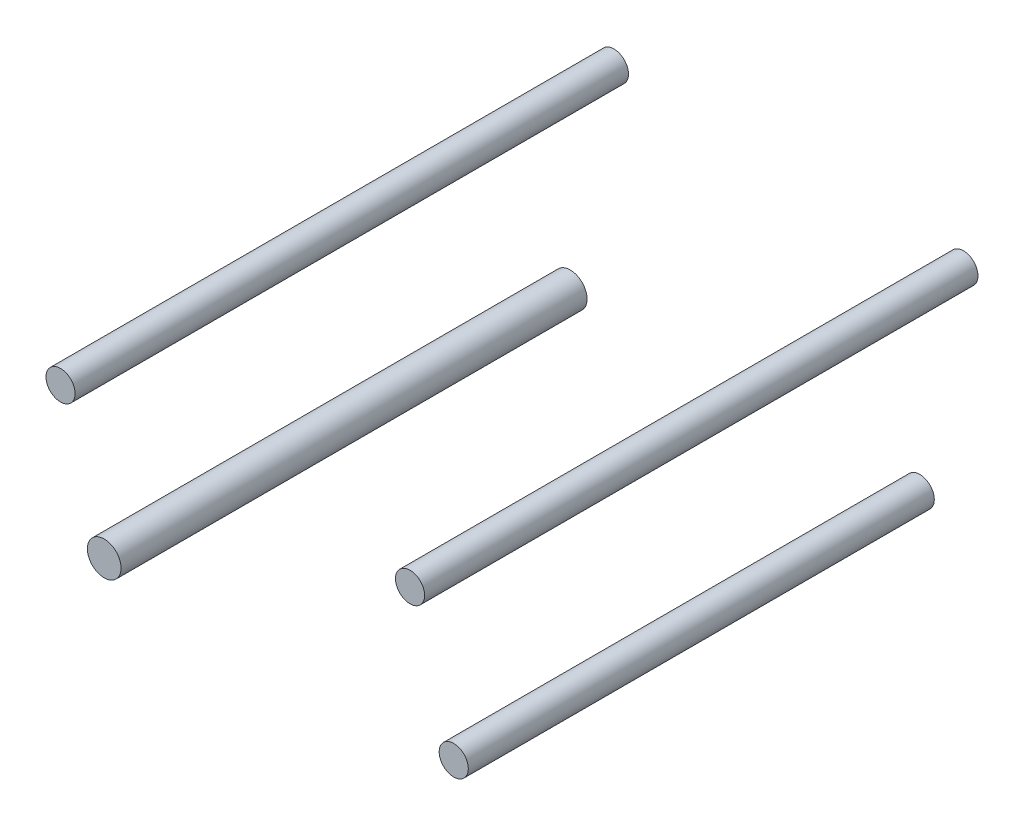
ISO-10303-21;
HEADER;
FILE_DESCRIPTION(('STEP AP214'),'2;1');
FILE_NAME('part.step','',(''),(''),'','','');
FILE_SCHEMA(('AUTOMOTIVE_DESIGN { 1 0 10303 214 1 1 1 1 }'));
ENDSEC;
DATA;
#1=APPLICATION_CONTEXT('core data for automotive mechanical design processes');
#2=APPLICATION_PROTOCOL_DEFINITION('international standard','automotive_design',2000,#1);
#3=PRODUCT_CONTEXT('',#1,'mechanical');
#4=PRODUCT('Part','Part','',(#3));
#5=PRODUCT_RELATED_PRODUCT_CATEGORY('part','',(#4));
#6=PRODUCT_DEFINITION_FORMATION('','',#4);
#7=PRODUCT_DEFINITION_CONTEXT('part definition',#1,'design');
#8=PRODUCT_DEFINITION('design','',#6,#7);
#9=PRODUCT_DEFINITION_SHAPE('','',#8);
#10=(LENGTH_UNIT() NAMED_UNIT(*) SI_UNIT(.MILLI.,.METRE.));
#11=(NAMED_UNIT(*) PLANE_ANGLE_UNIT() SI_UNIT($,.RADIAN.));
#12=(NAMED_UNIT(*) SI_UNIT($,.STERADIAN.) SOLID_ANGLE_UNIT());
#13=UNCERTAINTY_MEASURE_WITH_UNIT(LENGTH_MEASURE(1.E-05),#10,'distance_accuracy_value','');
#14=(GEOMETRIC_REPRESENTATION_CONTEXT(3) GLOBAL_UNCERTAINTY_ASSIGNED_CONTEXT((#13)) GLOBAL_UNIT_ASSIGNED_CONTEXT((#10,
#11,#12)) REPRESENTATION_CONTEXT('',''));
#15=CARTESIAN_POINT('',(0.,0.,0.));
#16=DIRECTION('',(0.,0.,1.));
#17=DIRECTION('',(1.,0.,0.));
#18=AXIS2_PLACEMENT_3D('',#15,#16,#17);
#19=CARTESIAN_POINT('',(-152.4,74.93,-241.3));
#20=DIRECTION('',(0.,0.,1.));
#21=DIRECTION('',(1.,0.,0.));
#22=AXIS2_PLACEMENT_3D('',#19,#20,#21);
#23=CYLINDRICAL_SURFACE('',#22,12.7);
#24=CARTESIAN_POINT('',(-152.4,74.93,-241.3));
#25=DIRECTION('',(0.,0.,1.));
#26=DIRECTION('',(1.,0.,0.));
#27=AXIS2_PLACEMENT_3D('',#24,#25,#26);
#28=CIRCLE('',#27,12.7);
#29=CARTESIAN_POINT('',(-139.7,74.93,-241.3));
#30=VERTEX_POINT('',#29);
#31=EDGE_CURVE('E53',#30,#30,#28,.T.);
#32=ORIENTED_EDGE('',*,*,#31,.T.);
#33=EDGE_LOOP('',(#32));
#34=FACE_BOUND('',#33,.T.);
#35=CARTESIAN_POINT('',(-152.4,74.93,241.3));
#36=DIRECTION('',(0.,0.,1.));
#37=DIRECTION('',(1.,0.,0.));
#38=AXIS2_PLACEMENT_3D('',#35,#36,#37);
#39=CIRCLE('',#38,12.7);
#40=CARTESIAN_POINT('',(-139.7,74.93,241.3));
#41=VERTEX_POINT('',#40);
#42=EDGE_CURVE('E11',#41,#41,#39,.T.);
#43=ORIENTED_EDGE('',*,*,#42,.F.);
#44=EDGE_LOOP('',(#43));
#45=FACE_BOUND('',#44,.T.);
#46=ADVANCED_FACE('F46',(#34,#45),#23,.T.);
#47=CARTESIAN_POINT('',(-152.4,74.93,-241.3));
#48=DIRECTION('',(0.,0.,1.));
#49=DIRECTION('',(1.,0.,0.));
#50=AXIS2_PLACEMENT_3D('',#47,#48,#49);
#51=PLANE('',#50);
#52=ORIENTED_EDGE('',*,*,#31,.F.);
#53=EDGE_LOOP('',(#52));
#54=FACE_BOUND('',#53,.T.);
#55=ADVANCED_FACE('F61',(#54),#51,.F.);
#56=CARTESIAN_POINT('',(-152.4,74.93,241.3));
#57=DIRECTION('',(0.,0.,1.));
#58=DIRECTION('',(1.,0.,0.));
#59=AXIS2_PLACEMENT_3D('',#56,#57,#58);
#60=PLANE('',#59);
#61=ORIENTED_EDGE('',*,*,#42,.T.);
#62=EDGE_LOOP('',(#61));
#63=FACE_BOUND('',#62,.T.);
#64=ADVANCED_FACE('F48',(#63),#60,.T.);
#65=CLOSED_SHELL('',(#46,#55,#64));
#66=MANIFOLD_SOLID_BREP('B2',#65);
#67=CARTESIAN_POINT('',(152.4,74.93,-241.3));
#68=DIRECTION('',(0.,0.,1.));
#69=DIRECTION('',(1.,0.,0.));
#70=AXIS2_PLACEMENT_3D('',#67,#68,#69);
#71=CYLINDRICAL_SURFACE('',#70,12.7);
#72=CARTESIAN_POINT('',(152.4,74.93,-241.3));
#73=DIRECTION('',(0.,0.,1.));
#74=DIRECTION('',(1.,0.,0.));
#75=AXIS2_PLACEMENT_3D('',#72,#73,#74);
#76=CIRCLE('',#75,12.7);
#77=CARTESIAN_POINT('',(165.1,74.93,-241.3));
#78=VERTEX_POINT('',#77);
#79=EDGE_CURVE('E45',#78,#78,#76,.T.);
#80=ORIENTED_EDGE('',*,*,#79,.T.);
#81=EDGE_LOOP('',(#80));
#82=FACE_BOUND('',#81,.T.);
#83=CARTESIAN_POINT('',(152.4,74.93,241.3));
#84=DIRECTION('',(0.,0.,1.));
#85=DIRECTION('',(1.,0.,0.));
#86=AXIS2_PLACEMENT_3D('',#83,#84,#85);
#87=CIRCLE('',#86,12.7);
#88=CARTESIAN_POINT('',(165.1,74.93,241.3));
#89=VERTEX_POINT('',#88);
#90=EDGE_CURVE('E101',#89,#89,#87,.T.);
#91=ORIENTED_EDGE('',*,*,#90,.F.);
#92=EDGE_LOOP('',(#91));
#93=FACE_BOUND('',#92,.T.);
#94=ADVANCED_FACE('F95',(#82,#93),#71,.T.);
#95=CARTESIAN_POINT('',(152.4,74.93,-241.3));
#96=DIRECTION('',(0.,0.,1.));
#97=DIRECTION('',(1.,0.,0.));
#98=AXIS2_PLACEMENT_3D('',#95,#96,#97);
#99=PLANE('',#98);
#100=ORIENTED_EDGE('',*,*,#79,.F.);
#101=EDGE_LOOP('',(#100));
#102=FACE_BOUND('',#101,.T.);
#103=ADVANCED_FACE('F110',(#102),#99,.F.);
#104=CARTESIAN_POINT('',(152.4,74.93,241.3));
#105=DIRECTION('',(0.,0.,1.));
#106=DIRECTION('',(1.,0.,0.));
#107=AXIS2_PLACEMENT_3D('',#104,#105,#106);
#108=PLANE('',#107);
#109=ORIENTED_EDGE('',*,*,#90,.T.);
#110=EDGE_LOOP('',(#109));
#111=FACE_BOUND('',#110,.T.);
#112=ADVANCED_FACE('F107',(#111),#108,.T.);
#113=CLOSED_SHELL('',(#94,#103,#112));
#114=MANIFOLD_SOLID_BREP('B6',#113);
#115=CARTESIAN_POINT('',(-152.4,-74.93,-203.2));
#116=DIRECTION('',(0.,0.,1.));
#117=DIRECTION('',(1.,0.,0.));
#118=AXIS2_PLACEMENT_3D('',#115,#116,#117);
#119=CYLINDRICAL_SURFACE('',#118,14.6942664875518);
#120=CARTESIAN_POINT('',(-152.4,-74.93,-203.2));
#121=DIRECTION('',(0.,0.,1.));
#122=DIRECTION('',(1.,0.,0.));
#123=AXIS2_PLACEMENT_3D('',#120,#121,#122);
#124=CIRCLE('',#123,14.6942664875518);
#125=CARTESIAN_POINT('',(-137.705733512448,-74.93,-203.2));
#126=VERTEX_POINT('',#125);
#127=EDGE_CURVE('E151',#126,#126,#124,.T.);
#128=ORIENTED_EDGE('',*,*,#127,.T.);
#129=EDGE_LOOP('',(#128));
#130=FACE_BOUND('',#129,.T.);
#131=CARTESIAN_POINT('',(-152.4,-74.93,203.2));
#132=DIRECTION('',(0.,0.,1.));
#133=DIRECTION('',(1.,0.,0.));
#134=AXIS2_PLACEMENT_3D('',#131,#132,#133);
#135=CIRCLE('',#134,14.6942664875518);
#136=CARTESIAN_POINT('',(-137.705733512448,-74.93,203.2));
#137=VERTEX_POINT('',#136);
#138=EDGE_CURVE('E94',#137,#137,#135,.T.);
#139=ORIENTED_EDGE('',*,*,#138,.F.);
#140=EDGE_LOOP('',(#139));
#141=FACE_BOUND('',#140,.T.);
#142=ADVANCED_FACE('F143',(#130,#141),#119,.T.);
#143=CARTESIAN_POINT('',(-152.4,-74.93,-203.2));
#144=DIRECTION('',(0.,0.,1.));
#145=DIRECTION('',(1.,0.,0.));
#146=AXIS2_PLACEMENT_3D('',#143,#144,#145);
#147=PLANE('',#146);
#148=ORIENTED_EDGE('',*,*,#127,.F.);
#149=EDGE_LOOP('',(#148));
#150=FACE_BOUND('',#149,.T.);
#151=ADVANCED_FACE('F160',(#150),#147,.F.);
#152=CARTESIAN_POINT('',(-152.4,-74.93,203.2));
#153=DIRECTION('',(0.,0.,1.));
#154=DIRECTION('',(1.,0.,0.));
#155=AXIS2_PLACEMENT_3D('',#152,#153,#154);
#156=PLANE('',#155);
#157=ORIENTED_EDGE('',*,*,#138,.T.);
#158=EDGE_LOOP('',(#157));
#159=FACE_BOUND('',#158,.T.);
#160=ADVANCED_FACE('F145',(#159),#156,.T.);
#161=CLOSED_SHELL('',(#142,#151,#160));
#162=MANIFOLD_SOLID_BREP('B40',#161);
#163=CARTESIAN_POINT('',(152.4,-74.93,-203.2));
#164=DIRECTION('',(0.,0.,1.));
#165=DIRECTION('',(1.,0.,0.));
#166=AXIS2_PLACEMENT_3D('',#163,#164,#165);
#167=CYLINDRICAL_SURFACE('',#166,12.7);
#168=CARTESIAN_POINT('',(152.4,-74.93,-203.2));
#169=DIRECTION('',(0.,0.,1.));
#170=DIRECTION('',(1.,0.,0.));
#171=AXIS2_PLACEMENT_3D('',#168,#169,#170);
#172=CIRCLE('',#171,12.7);
#173=CARTESIAN_POINT('',(165.1,-74.93,-203.2));
#174=VERTEX_POINT('',#173);
#175=EDGE_CURVE('E142',#174,#174,#172,.T.);
#176=ORIENTED_EDGE('',*,*,#175,.T.);
#177=EDGE_LOOP('',(#176));
#178=FACE_BOUND('',#177,.T.);
#179=CARTESIAN_POINT('',(152.4,-74.93,203.2));
#180=DIRECTION('',(0.,0.,1.));
#181=DIRECTION('',(1.,0.,0.));
#182=AXIS2_PLACEMENT_3D('',#179,#180,#181);
#183=CIRCLE('',#182,12.7);
#184=CARTESIAN_POINT('',(165.1,-74.93,203.2));
#185=VERTEX_POINT('',#184);
#186=EDGE_CURVE('E192',#185,#185,#183,.T.);
#187=ORIENTED_EDGE('',*,*,#186,.F.);
#188=EDGE_LOOP('',(#187));
#189=FACE_BOUND('',#188,.T.);
#190=ADVANCED_FACE('F186',(#178,#189),#167,.T.);
#191=CARTESIAN_POINT('',(152.4,-74.93,-203.2));
#192=DIRECTION('',(0.,0.,1.));
#193=DIRECTION('',(1.,0.,0.));
#194=AXIS2_PLACEMENT_3D('',#191,#192,#193);
#195=PLANE('',#194);
#196=ORIENTED_EDGE('',*,*,#175,.F.);
#197=EDGE_LOOP('',(#196));
#198=FACE_BOUND('',#197,.T.);
#199=ADVANCED_FACE('F201',(#198),#195,.F.);
#200=CARTESIAN_POINT('',(152.4,-74.93,203.2));
#201=DIRECTION('',(0.,0.,1.));
#202=DIRECTION('',(1.,0.,0.));
#203=AXIS2_PLACEMENT_3D('',#200,#201,#202);
#204=PLANE('',#203);
#205=ORIENTED_EDGE('',*,*,#186,.T.);
#206=EDGE_LOOP('',(#205));
#207=FACE_BOUND('',#206,.T.);
#208=ADVANCED_FACE('F198',(#207),#204,.T.);
#209=CLOSED_SHELL('',(#190,#199,#208));
#210=MANIFOLD_SOLID_BREP('B89',#209);
#211=ADVANCED_BREP_SHAPE_REPRESENTATION('',(#18,#66,#114,#162,#210),#14);
#212=SHAPE_DEFINITION_REPRESENTATION(#9,#211);
ENDSEC;
END-ISO-10303-21;
